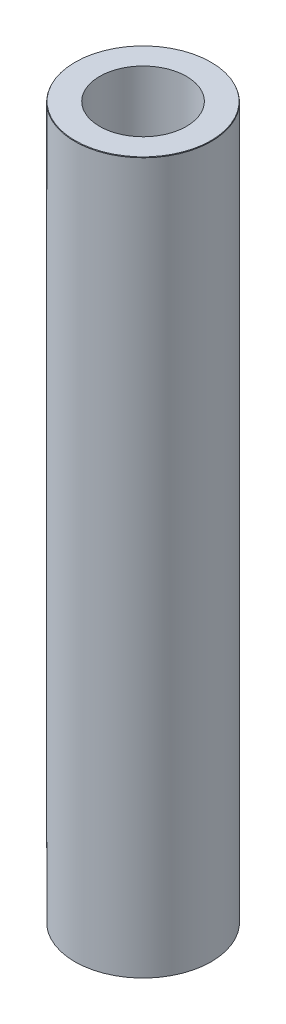
ISO-10303-21;
HEADER;
FILE_DESCRIPTION(('STEP AP214'),'2;1');
FILE_NAME('part.step','',(''),(''),'','','');
FILE_SCHEMA(('AUTOMOTIVE_DESIGN { 1 0 10303 214 1 1 1 1 }'));
ENDSEC;
DATA;
#1=APPLICATION_CONTEXT('core data for automotive mechanical design processes');
#2=APPLICATION_PROTOCOL_DEFINITION('international standard','automotive_design',2000,#1);
#3=PRODUCT_CONTEXT('',#1,'mechanical');
#4=PRODUCT('Part','Part','',(#3));
#5=PRODUCT_RELATED_PRODUCT_CATEGORY('part','',(#4));
#6=PRODUCT_DEFINITION_FORMATION('','',#4);
#7=PRODUCT_DEFINITION_CONTEXT('part definition',#1,'design');
#8=PRODUCT_DEFINITION('design','',#6,#7);
#9=PRODUCT_DEFINITION_SHAPE('','',#8);
#10=(LENGTH_UNIT() NAMED_UNIT(*) SI_UNIT(.MILLI.,.METRE.));
#11=(NAMED_UNIT(*) PLANE_ANGLE_UNIT() SI_UNIT($,.RADIAN.));
#12=(NAMED_UNIT(*) SI_UNIT($,.STERADIAN.) SOLID_ANGLE_UNIT());
#13=UNCERTAINTY_MEASURE_WITH_UNIT(LENGTH_MEASURE(1.E-05),#10,'distance_accuracy_value','');
#14=(GEOMETRIC_REPRESENTATION_CONTEXT(3) GLOBAL_UNCERTAINTY_ASSIGNED_CONTEXT((#13)) GLOBAL_UNIT_ASSIGNED_CONTEXT((#10,
#11,#12)) REPRESENTATION_CONTEXT('',''));
#15=CARTESIAN_POINT('',(0.,0.,0.));
#16=DIRECTION('',(0.,0.,1.));
#17=DIRECTION('',(1.,0.,0.));
#18=AXIS2_PLACEMENT_3D('',#15,#16,#17);
#19=CARTESIAN_POINT('',(0.,495.366377588799,0.));
#20=DIRECTION('',(0.,-1.,0.));
#21=DIRECTION('',(0.,0.,-1.));
#22=AXIS2_PLACEMENT_3D('',#19,#20,#21);
#23=CYLINDRICAL_SURFACE('',#22,47.5);
#24=CARTESIAN_POINT('',(0.,494.905472453745,0.));
#25=DIRECTION('',(0.,1.,0.));
#26=DIRECTION('',(0.,0.,1.));
#27=AXIS2_PLACEMENT_3D('',#24,#25,#26);
#28=CIRCLE('',#27,47.5);
#29=CARTESIAN_POINT('',(0.,494.905472453745,-47.5));
#30=VERTEX_POINT('',#29);
#31=EDGE_CURVE('E50',#30,#30,#28,.F.);
#32=CARTESIAN_POINT('',(0.,0.178432489708724,0.));
#33=DIRECTION('',(0.,1.,0.));
#34=DIRECTION('',(0.,0.,1.));
#35=AXIS2_PLACEMENT_3D('',#32,#33,#34);
#36=CIRCLE('',#35,47.5);
#37=CARTESIAN_POINT('',(0.,0.178432489708669,-47.5));
#38=VERTEX_POINT('',#37);
#39=EDGE_CURVE('E51',#38,#38,#36,.T.);
#40=CARTESIAN_POINT('',(0.,494.905472453745,-47.5));
#41=CARTESIAN_POINT('',(0.,489.752065787453,-47.5));
#42=CARTESIAN_POINT('',(0.,484.598659121161,-47.5));
#43=CARTESIAN_POINT('',(0.,474.291845788577,-47.5));
#44=CARTESIAN_POINT('',(0.,469.138439122285,-47.5));
#45=CARTESIAN_POINT('',(0.,458.831625789701,-47.5));
#46=CARTESIAN_POINT('',(0.,453.678219123409,-47.5));
#47=CARTESIAN_POINT('',(0.,443.371405790825,-47.5));
#48=CARTESIAN_POINT('',(0.,438.217999124533,-47.5));
#49=CARTESIAN_POINT('',(0.,427.911185791949,-47.5));
#50=CARTESIAN_POINT('',(0.,422.757779125657,-47.5));
#51=CARTESIAN_POINT('',(0.,412.450965793073,-47.5));
#52=CARTESIAN_POINT('',(0.,407.297559126781,-47.5));
#53=CARTESIAN_POINT('',(0.,396.990745794196,-47.5));
#54=CARTESIAN_POINT('',(0.,391.837339127904,-47.5));
#55=CARTESIAN_POINT('',(0.,381.53052579532,-47.5));
#56=CARTESIAN_POINT('',(0.,376.377119129028,-47.5));
#57=CARTESIAN_POINT('',(0.,366.070305796444,-47.5));
#58=CARTESIAN_POINT('',(0.,360.916899130152,-47.5));
#59=CARTESIAN_POINT('',(0.,350.610085797568,-47.5));
#60=CARTESIAN_POINT('',(0.,345.456679131276,-47.5));
#61=CARTESIAN_POINT('',(0.,335.149865798692,-47.5));
#62=CARTESIAN_POINT('',(0.,329.9964591324,-47.5));
#63=CARTESIAN_POINT('',(0.,319.689645799816,-47.5));
#64=CARTESIAN_POINT('',(0.,314.536239133524,-47.5));
#65=CARTESIAN_POINT('',(0.,304.22942580094,-47.5));
#66=CARTESIAN_POINT('',(0.,299.076019134648,-47.5));
#67=CARTESIAN_POINT('',(0.,288.769205802063,-47.5));
#68=CARTESIAN_POINT('',(0.,283.615799135771,-47.5));
#69=CARTESIAN_POINT('',(0.,273.308985803187,-47.5));
#70=CARTESIAN_POINT('',(0.,268.155579136895,-47.5));
#71=CARTESIAN_POINT('',(0.,257.848765804311,-47.5));
#72=CARTESIAN_POINT('',(0.,252.695359138019,-47.5));
#73=CARTESIAN_POINT('',(0.,242.388545805435,-47.5));
#74=CARTESIAN_POINT('',(0.,237.235139139143,-47.5));
#75=CARTESIAN_POINT('',(0.,226.928325806559,-47.5));
#76=CARTESIAN_POINT('',(0.,221.774919140267,-47.5));
#77=CARTESIAN_POINT('',(0.,211.468105807683,-47.5));
#78=CARTESIAN_POINT('',(0.,206.314699141391,-47.5));
#79=CARTESIAN_POINT('',(0.,196.007885808807,-47.5));
#80=CARTESIAN_POINT('',(0.,190.854479142515,-47.5));
#81=CARTESIAN_POINT('',(0.,180.54766580993,-47.5));
#82=CARTESIAN_POINT('',(0.,175.394259143638,-47.5));
#83=CARTESIAN_POINT('',(0.,165.087445811054,-47.5));
#84=CARTESIAN_POINT('',(0.,159.934039144762,-47.5));
#85=CARTESIAN_POINT('',(0.,149.627225812178,-47.5));
#86=CARTESIAN_POINT('',(0.,144.473819145886,-47.5));
#87=CARTESIAN_POINT('',(0.,134.167005813302,-47.5));
#88=CARTESIAN_POINT('',(0.,129.01359914701,-47.5));
#89=CARTESIAN_POINT('',(0.,118.706785814426,-47.5));
#90=CARTESIAN_POINT('',(0.,113.553379148134,-47.5));
#91=CARTESIAN_POINT('',(0.,103.24656581555,-47.5));
#92=CARTESIAN_POINT('',(0.,98.0931591492576,-47.5));
#93=CARTESIAN_POINT('',(0.,87.7863458166735,-47.5));
#94=CARTESIAN_POINT('',(0.,82.6329391503814,-47.5));
#95=CARTESIAN_POINT('',(0.,72.3261258177973,-47.5));
#96=CARTESIAN_POINT('',(0.,67.1727191515053,-47.5));
#97=CARTESIAN_POINT('',(0.,56.8659058189212,-47.5));
#98=CARTESIAN_POINT('',(0.,51.7124991526292,-47.5));
#99=CARTESIAN_POINT('',(0.,41.4056858200451,-47.5));
#100=CARTESIAN_POINT('',(0.,36.252279153753,-47.5));
#101=CARTESIAN_POINT('',(0.,25.9454658211689,-47.5));
#102=CARTESIAN_POINT('',(0.,20.7920591548769,-47.5));
#103=CARTESIAN_POINT('',(0.,10.4852458222928,-47.5));
#104=CARTESIAN_POINT('',(0.,5.33183915600071,-47.5));
#105=CARTESIAN_POINT('',(0.,0.178432489708669,-47.5));
#106=B_SPLINE_CURVE_WITH_KNOTS('',3,(#40,#41,#42,#43,#44,#45,#46,#47,#48,#49,#50,#51,#52,#53,
#54,#55,#56,#57,#58,#59,#60,#61,#62,#63,#64,#65,#66,#67,#68,#69,#70,#71,#72,#73,#74,#75,#76,#77,
#78,#79,#80,#81,#82,#83,#84,#85,#86,#87,#88,#89,#90,#91,#92,#93,#94,#95,#96,#97,#98,#99,#100,
#101,#102,#103,#104,#105),.UNSPECIFIED.,.F.,.F.,(4,2,2,2,2,2,2,2,2,2,2,2,2,2,2,2,2,2,2,2,2,2,2,
2,2,2,2,2,2,2,2,2,4),(0.,15.4602199988762,30.9204399977523,46.3806599966285,61.8408799955046,
77.3010999943808,92.7613199932569,108.221539992133,123.681759991009,139.141979989885,
154.602199988762,170.062419987638,185.522639986514,200.98285998539,216.443079984266,
231.903299983142,247.363519982018,262.823739980894,278.283959979771,293.744179978647,
309.204399977523,324.664619976399,340.124839975275,355.585059974151,371.045279973028,
386.505499971904,401.96571997078,417.425939969656,432.886159968532,448.346379967408,
463.806599966284,479.266819965161,494.727039964037),.UNSPECIFIED.);
#107=EDGE_CURVE('BSEAM39',#30,#38,#106,.T.);
#108=ORIENTED_EDGE('',*,*,#31,.T.);
#109=ORIENTED_EDGE('',*,*,#39,.T.);
#110=ORIENTED_EDGE('',*,*,#107,.T.);
#111=ORIENTED_EDGE('',*,*,#107,.F.);
#112=EDGE_LOOP('',(#108,#110,#109,#111));
#113=FACE_BOUND('',#112,.T.);
#114=ADVANCED_FACE('F39',(#113),#23,.T.);
#115=CARTESIAN_POINT('',(0.,495.366377588799,0.));
#116=DIRECTION('',(0.,1.,0.));
#117=DIRECTION('',(0.,0.,1.));
#118=AXIS2_PLACEMENT_3D('',#115,#116,#117);
#119=PLANE('',#118);
#120=CARTESIAN_POINT('',(0.,495.366377588799,0.));
#121=DIRECTION('',(0.,1.,0.));
#122=DIRECTION('',(0.,0.,1.));
#123=AXIS2_PLACEMENT_3D('',#120,#121,#122);
#124=CIRCLE('',#123,47.3215675102917);
#125=CARTESIAN_POINT('',(0.,495.366377588799,47.3215675102917));
#126=VERTEX_POINT('',#125);
#127=EDGE_CURVE('E54',#126,#126,#124,.T.);
#128=ORIENTED_EDGE('',*,*,#127,.T.);
#129=EDGE_LOOP('',(#128));
#130=FACE_BOUND('',#129,.T.);
#131=CARTESIAN_POINT('',(0.,495.366377588799,0.));
#132=DIRECTION('',(0.,1.,0.));
#133=DIRECTION('',(0.,0.,1.));
#134=AXIS2_PLACEMENT_3D('',#131,#132,#133);
#135=CIRCLE('',#134,30.2171366173608);
#136=CARTESIAN_POINT('',(0.,495.366377588799,-30.2171366173608));
#137=VERTEX_POINT('',#136);
#138=EDGE_CURVE('E58',#137,#137,#135,.T.);
#139=ORIENTED_EDGE('',*,*,#138,.F.);
#140=EDGE_LOOP('',(#139));
#141=FACE_BOUND('',#140,.T.);
#142=ADVANCED_FACE('F69',(#130,#141),#119,.T.);
#143=CARTESIAN_POINT('',(0.,0.,0.));
#144=DIRECTION('',(0.,1.,0.));
#145=DIRECTION('',(0.,0.,1.));
#146=AXIS2_PLACEMENT_3D('',#143,#144,#145);
#147=PLANE('',#146);
#148=CARTESIAN_POINT('',(0.,0.,0.));
#149=DIRECTION('',(0.,1.,0.));
#150=DIRECTION('',(0.,0.,1.));
#151=AXIS2_PLACEMENT_3D('',#148,#149,#150);
#152=CIRCLE('',#151,47.0390948649453);
#153=CARTESIAN_POINT('',(0.,0.,47.0390948649453));
#154=VERTEX_POINT('',#153);
#155=EDGE_CURVE('E10',#154,#154,#152,.F.);
#156=ORIENTED_EDGE('',*,*,#155,.T.);
#157=EDGE_LOOP('',(#156));
#158=FACE_BOUND('',#157,.T.);
#159=CARTESIAN_POINT('',(0.,0.,0.));
#160=DIRECTION('',(0.,1.,0.));
#161=DIRECTION('',(0.,0.,1.));
#162=AXIS2_PLACEMENT_3D('',#159,#160,#161);
#163=CIRCLE('',#162,30.2171366173608);
#164=CARTESIAN_POINT('',(0.,0.,-30.2171366173608));
#165=VERTEX_POINT('',#164);
#166=EDGE_CURVE('E63',#165,#165,#163,.T.);
#167=ORIENTED_EDGE('',*,*,#166,.T.);
#168=EDGE_LOOP('',(#167));
#169=FACE_BOUND('',#168,.T.);
#170=ADVANCED_FACE('F75',(#158,#169),#147,.F.);
#171=CARTESIAN_POINT('',(0.,495.366377588799,0.));
#172=DIRECTION('',(0.,-1.,0.));
#173=DIRECTION('',(0.,0.,-1.));
#174=AXIS2_PLACEMENT_3D('',#171,#172,#173);
#175=CYLINDRICAL_SURFACE('',#174,30.2171366173608);
#176=CARTESIAN_POINT('',(0.,495.366377588799,-30.2171366173608));
#177=CARTESIAN_POINT('',(0.,490.206311155582,-30.2171366173608));
#178=CARTESIAN_POINT('',(0.,485.046244722366,-30.2171366173608));
#179=CARTESIAN_POINT('',(0.,474.726111855932,-30.2171366173608));
#180=CARTESIAN_POINT('',(0.,469.566045422716,-30.2171366173608));
#181=CARTESIAN_POINT('',(0.,459.245912556282,-30.2171366173608));
#182=CARTESIAN_POINT('',(0.,454.085846123066,-30.2171366173608));
#183=CARTESIAN_POINT('',(0.,443.765713256632,-30.2171366173608));
#184=CARTESIAN_POINT('',(0.,438.605646823416,-30.2171366173608));
#185=CARTESIAN_POINT('',(0.,428.285513956982,-30.2171366173608));
#186=CARTESIAN_POINT('',(0.,423.125447523766,-30.2171366173608));
#187=CARTESIAN_POINT('',(0.,412.805314657332,-30.2171366173608));
#188=CARTESIAN_POINT('',(0.,407.645248224116,-30.2171366173608));
#189=CARTESIAN_POINT('',(0.,397.325115357682,-30.2171366173608));
#190=CARTESIAN_POINT('',(0.,392.165048924466,-30.2171366173608));
#191=CARTESIAN_POINT('',(0.,381.844916058032,-30.2171366173608));
#192=CARTESIAN_POINT('',(0.,376.684849624816,-30.2171366173608));
#193=CARTESIAN_POINT('',(0.,366.364716758382,-30.2171366173608));
#194=CARTESIAN_POINT('',(0.,361.204650325166,-30.2171366173608));
#195=CARTESIAN_POINT('',(0.,350.884517458732,-30.2171366173608));
#196=CARTESIAN_POINT('',(0.,345.724451025516,-30.2171366173608));
#197=CARTESIAN_POINT('',(0.,335.404318159083,-30.2171366173608));
#198=CARTESIAN_POINT('',(0.,330.244251725866,-30.2171366173608));
#199=CARTESIAN_POINT('',(0.,319.924118859433,-30.2171366173608));
#200=CARTESIAN_POINT('',(0.,314.764052426216,-30.2171366173608));
#201=CARTESIAN_POINT('',(0.,304.443919559783,-30.2171366173608));
#202=CARTESIAN_POINT('',(0.,299.283853126566,-30.2171366173608));
#203=CARTESIAN_POINT('',(0.,288.963720260133,-30.2171366173608));
#204=CARTESIAN_POINT('',(0.,283.803653826916,-30.2171366173608));
#205=CARTESIAN_POINT('',(0.,273.483520960483,-30.2171366173608));
#206=CARTESIAN_POINT('',(0.,268.323454527266,-30.2171366173608));
#207=CARTESIAN_POINT('',(0.,258.003321660833,-30.2171366173608));
#208=CARTESIAN_POINT('',(0.,252.843255227616,-30.2171366173608));
#209=CARTESIAN_POINT('',(0.,242.523122361183,-30.2171366173608));
#210=CARTESIAN_POINT('',(0.,237.363055927966,-30.2171366173608));
#211=CARTESIAN_POINT('',(0.,227.042923061533,-30.2171366173608));
#212=CARTESIAN_POINT('',(0.,221.882856628316,-30.2171366173608));
#213=CARTESIAN_POINT('',(0.,211.562723761883,-30.2171366173608));
#214=CARTESIAN_POINT('',(0.,206.402657328666,-30.2171366173608));
#215=CARTESIAN_POINT('',(0.,196.082524462233,-30.2171366173608));
#216=CARTESIAN_POINT('',(0.,190.922458029016,-30.2171366173608));
#217=CARTESIAN_POINT('',(0.,180.602325162583,-30.2171366173608));
#218=CARTESIAN_POINT('',(0.,175.442258729366,-30.2171366173608));
#219=CARTESIAN_POINT('',(0.,165.122125862933,-30.2171366173608));
#220=CARTESIAN_POINT('',(0.,159.962059429716,-30.2171366173608));
#221=CARTESIAN_POINT('',(0.,149.641926563283,-30.2171366173608));
#222=CARTESIAN_POINT('',(0.,144.481860130066,-30.2171366173608));
#223=CARTESIAN_POINT('',(0.,134.161727263633,-30.2171366173608));
#224=CARTESIAN_POINT('',(0.,129.001660830416,-30.2171366173608));
#225=CARTESIAN_POINT('',(0.,118.681527963983,-30.2171366173608));
#226=CARTESIAN_POINT('',(0.,113.521461530766,-30.2171366173608));
#227=CARTESIAN_POINT('',(0.,103.201328664333,-30.2171366173608));
#228=CARTESIAN_POINT('',(0.,98.0412622311164,-30.2171366173608));
#229=CARTESIAN_POINT('',(0.,87.7211293646831,-30.2171366173608));
#230=CARTESIAN_POINT('',(0.,82.5610629314664,-30.2171366173608));
#231=CARTESIAN_POINT('',(0.,72.2409300650331,-30.2171366173608));
#232=CARTESIAN_POINT('',(0.,67.0808636318165,-30.2171366173608));
#233=CARTESIAN_POINT('',(0.,56.7607307653832,-30.2171366173608));
#234=CARTESIAN_POINT('',(0.,51.6006643321665,-30.2171366173608));
#235=CARTESIAN_POINT('',(0.,41.2805314657332,-30.2171366173608));
#236=CARTESIAN_POINT('',(0.,36.1204650325165,-30.2171366173608));
#237=CARTESIAN_POINT('',(0.,25.8003321660832,-30.2171366173608));
#238=CARTESIAN_POINT('',(0.,20.6402657328666,-30.2171366173608));
#239=CARTESIAN_POINT('',(0.,10.3201328664332,-30.2171366173608));
#240=CARTESIAN_POINT('',(0.,5.16006643321659,-30.2171366173608));
#241=CARTESIAN_POINT('',(0.,0.,-30.2171366173608));
#242=B_SPLINE_CURVE_WITH_KNOTS('',3,(#176,#177,#178,#179,#180,#181,#182,#183,#184,#185,#186,
#187,#188,#189,#190,#191,#192,#193,#194,#195,#196,#197,#198,#199,#200,#201,#202,#203,#204,#205,
#206,#207,#208,#209,#210,#211,#212,#213,#214,#215,#216,#217,#218,#219,#220,#221,#222,#223,#224,
#225,#226,#227,#228,#229,#230,#231,#232,#233,#234,#235,#236,#237,#238,#239,#240,#241),
.UNSPECIFIED.,.F.,.F.,(4,2,2,2,2,2,2,2,2,2,2,2,2,2,2,2,2,2,2,2,2,2,2,2,2,2,2,2,2,2,2,2,4),(0.,
15.48019929965,30.9603985992999,46.4405978989499,61.9207971985999,77.4009964982498,
92.8811957978998,108.36139509755,123.8415943972,139.32179369685,154.8019929965,170.28219229615,
185.7623915958,201.24259089545,216.7227901951,232.202989494749,247.683188794399,
263.163388094049,278.643587393699,294.123786693349,309.603985992999,325.084185292649,
340.564384592299,356.044583891949,371.524783191599,387.004982491249,402.485181790899,
417.965381090549,433.445580390199,448.925779689849,464.405978989499,479.886178289149,
495.366377588799),.UNSPECIFIED.);
#243=EDGE_CURVE('BSEAM70',#137,#165,#242,.T.);
#244=ORIENTED_EDGE('',*,*,#138,.T.);
#245=ORIENTED_EDGE('',*,*,#166,.F.);
#246=ORIENTED_EDGE('',*,*,#243,.T.);
#247=ORIENTED_EDGE('',*,*,#243,.F.);
#248=EDGE_LOOP('',(#244,#246,#245,#247));
#249=FACE_BOUND('',#248,.T.);
#250=ADVANCED_FACE('F70',(#249),#175,.F.);
#251=CARTESIAN_POINT('',(0.,495.366377588799,0.));
#252=DIRECTION('',(0.,-1.,0.));
#253=DIRECTION('',(0.,0.,-1.));
#254=AXIS2_PLACEMENT_3D('',#251,#252,#253);
#255=CONICAL_SURFACE('',#254,47.3215675102917,0.369366864323138);
#256=ORIENTED_EDGE('',*,*,#31,.F.);
#257=EDGE_LOOP('',(#256));
#258=FACE_BOUND('',#257,.T.);
#259=ORIENTED_EDGE('',*,*,#127,.F.);
#260=EDGE_LOOP('',(#259));
#261=FACE_BOUND('',#260,.T.);
#262=ADVANCED_FACE('F81',(#258,#261),#255,.T.);
#263=CARTESIAN_POINT('',(0.,0.178432489708724,0.));
#264=DIRECTION('',(0.,1.,0.));
#265=DIRECTION('',(0.,0.,1.));
#266=AXIS2_PLACEMENT_3D('',#263,#264,#265);
#267=CONICAL_SURFACE('',#266,47.5,1.20142946247183);
#268=ORIENTED_EDGE('',*,*,#155,.F.);
#269=EDGE_LOOP('',(#268));
#270=FACE_BOUND('',#269,.T.);
#271=ORIENTED_EDGE('',*,*,#39,.F.);
#272=EDGE_LOOP('',(#271));
#273=FACE_BOUND('',#272,.T.);
#274=ADVANCED_FACE('F45',(#270,#273),#267,.T.);
#275=CLOSED_SHELL('',(#114,#142,#170,#250,#262,#274));
#276=MANIFOLD_SOLID_BREP('B2',#275);
#277=ADVANCED_BREP_SHAPE_REPRESENTATION('',(#18,#276),#14);
#278=SHAPE_DEFINITION_REPRESENTATION(#9,#277);
ENDSEC;
END-ISO-10303-21;
